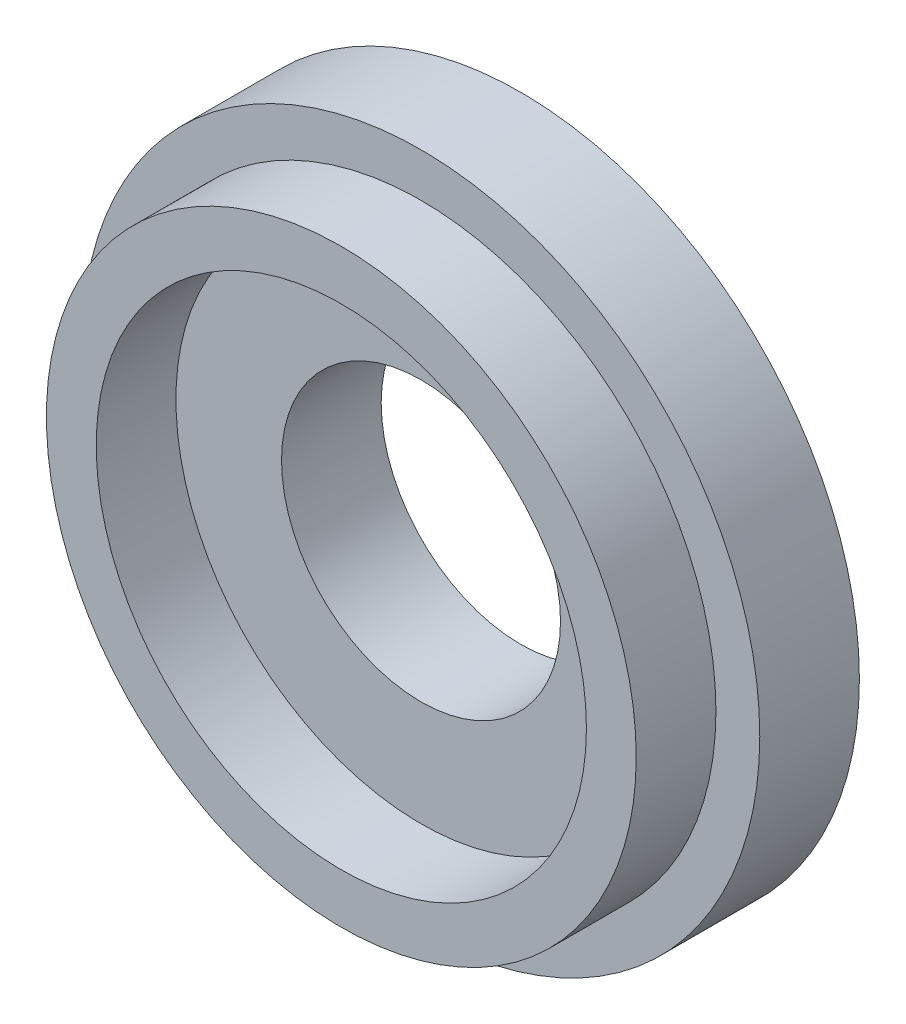
ISO-10303-21;
HEADER;
FILE_DESCRIPTION(('STEP AP214'),'2;1');
FILE_NAME('part.step','',(''),(''),'','','');
FILE_SCHEMA(('AUTOMOTIVE_DESIGN { 1 0 10303 214 1 1 1 1 }'));
ENDSEC;
DATA;
#1=APPLICATION_CONTEXT('core data for automotive mechanical design processes');
#2=APPLICATION_PROTOCOL_DEFINITION('international standard','automotive_design',2000,#1);
#3=PRODUCT_CONTEXT('',#1,'mechanical');
#4=PRODUCT('Part','Part','',(#3));
#5=PRODUCT_RELATED_PRODUCT_CATEGORY('part','',(#4));
#6=PRODUCT_DEFINITION_FORMATION('','',#4);
#7=PRODUCT_DEFINITION_CONTEXT('part definition',#1,'design');
#8=PRODUCT_DEFINITION('design','',#6,#7);
#9=PRODUCT_DEFINITION_SHAPE('','',#8);
#10=(LENGTH_UNIT() NAMED_UNIT(*) SI_UNIT(.MILLI.,.METRE.));
#11=(NAMED_UNIT(*) PLANE_ANGLE_UNIT() SI_UNIT($,.RADIAN.));
#12=(NAMED_UNIT(*) SI_UNIT($,.STERADIAN.) SOLID_ANGLE_UNIT());
#13=UNCERTAINTY_MEASURE_WITH_UNIT(LENGTH_MEASURE(1.E-05),#10,'distance_accuracy_value','');
#14=(GEOMETRIC_REPRESENTATION_CONTEXT(3) GLOBAL_UNCERTAINTY_ASSIGNED_CONTEXT((#13)) GLOBAL_UNIT_ASSIGNED_CONTEXT((#10,
#11,#12)) REPRESENTATION_CONTEXT('',''));
#15=CARTESIAN_POINT('',(0.,0.,0.));
#16=DIRECTION('',(0.,0.,1.));
#17=DIRECTION('',(1.,0.,0.));
#18=AXIS2_PLACEMENT_3D('',#15,#16,#17);
#19=CARTESIAN_POINT('',(0.,3.5,1.90952321796817));
#20=DIRECTION('',(0.,0.,1.));
#21=DIRECTION('',(1.,0.,0.));
#22=AXIS2_PLACEMENT_3D('',#19,#20,#21);
#23=PLANE('',#22);
#24=CARTESIAN_POINT('',(0.,0.,1.90952321796817));
#25=DIRECTION('',(0.,0.,1.));
#26=DIRECTION('',(1.,0.,0.));
#27=AXIS2_PLACEMENT_3D('',#24,#25,#26);
#28=CIRCLE('',#27,8.5);
#29=CARTESIAN_POINT('',(8.5,0.,1.90952321796817));
#30=VERTEX_POINT('',#29);
#31=EDGE_CURVE('E72',#30,#30,#28,.T.);
#32=ORIENTED_EDGE('',*,*,#31,.F.);
#33=EDGE_LOOP('',(#32));
#34=FACE_BOUND('',#33,.T.);
#35=CARTESIAN_POINT('',(0.,0.,1.90952321796817));
#36=DIRECTION('',(0.,0.,1.));
#37=DIRECTION('',(1.,0.,0.));
#38=AXIS2_PLACEMENT_3D('',#35,#36,#37);
#39=CIRCLE('',#38,3.5);
#40=CARTESIAN_POINT('',(3.5,0.,1.90952321796817));
#41=VERTEX_POINT('',#40);
#42=EDGE_CURVE('E10',#41,#41,#39,.T.);
#43=ORIENTED_EDGE('',*,*,#42,.T.);
#44=EDGE_LOOP('',(#43));
#45=FACE_BOUND('',#44,.T.);
#46=ADVANCED_FACE('F37',(#34,#45),#23,.F.);
#47=CARTESIAN_POINT('',(0.,0.,52.974875507707));
#48=DIRECTION('',(0.,0.,1.));
#49=DIRECTION('',(1.,0.,0.));
#50=AXIS2_PLACEMENT_3D('',#47,#48,#49);
#51=CYLINDRICAL_SURFACE('',#50,3.5);
#52=ORIENTED_EDGE('',*,*,#42,.F.);
#53=EDGE_LOOP('',(#52));
#54=FACE_BOUND('',#53,.T.);
#55=CARTESIAN_POINT('',(0.,0.,4.40952321796817));
#56=DIRECTION('',(0.,0.,1.));
#57=DIRECTION('',(1.,0.,0.));
#58=AXIS2_PLACEMENT_3D('',#55,#56,#57);
#59=CIRCLE('',#58,3.5);
#60=CARTESIAN_POINT('',(3.5,0.,4.40952321796817));
#61=VERTEX_POINT('',#60);
#62=EDGE_CURVE('E44',#61,#61,#59,.T.);
#63=ORIENTED_EDGE('',*,*,#62,.T.);
#64=EDGE_LOOP('',(#63));
#65=FACE_BOUND('',#64,.T.);
#66=ADVANCED_FACE('F80',(#54,#65),#51,.F.);
#67=CARTESIAN_POINT('',(0.,4.25,4.40952321796817));
#68=DIRECTION('',(0.,0.,-1.));
#69=DIRECTION('',(-1.,0.,0.));
#70=AXIS2_PLACEMENT_3D('',#67,#68,#69);
#71=PLANE('',#70);
#72=ORIENTED_EDGE('',*,*,#62,.F.);
#73=EDGE_LOOP('',(#72));
#74=FACE_BOUND('',#73,.T.);
#75=CARTESIAN_POINT('',(0.,0.,4.40952321796817));
#76=DIRECTION('',(0.,0.,1.));
#77=DIRECTION('',(1.,0.,0.));
#78=AXIS2_PLACEMENT_3D('',#75,#76,#77);
#79=CIRCLE('',#78,6.15);
#80=CARTESIAN_POINT('',(6.15,0.,4.40952321796817));
#81=VERTEX_POINT('',#80);
#82=EDGE_CURVE('E49',#81,#81,#79,.T.);
#83=ORIENTED_EDGE('',*,*,#82,.T.);
#84=EDGE_LOOP('',(#83));
#85=FACE_BOUND('',#84,.T.);
#86=ADVANCED_FACE('F84',(#74,#85),#71,.F.);
#87=CARTESIAN_POINT('',(0.,0.,52.974875507707));
#88=DIRECTION('',(0.,0.,1.));
#89=DIRECTION('',(1.,0.,0.));
#90=AXIS2_PLACEMENT_3D('',#87,#88,#89);
#91=CYLINDRICAL_SURFACE('',#90,6.15);
#92=ORIENTED_EDGE('',*,*,#82,.F.);
#93=EDGE_LOOP('',(#92));
#94=FACE_BOUND('',#93,.T.);
#95=CARTESIAN_POINT('',(0.,0.,6.40952321796817));
#96=DIRECTION('',(0.,0.,1.));
#97=DIRECTION('',(1.,0.,0.));
#98=AXIS2_PLACEMENT_3D('',#95,#96,#97);
#99=CIRCLE('',#98,6.15);
#100=CARTESIAN_POINT('',(6.15,0.,6.40952321796817));
#101=VERTEX_POINT('',#100);
#102=EDGE_CURVE('E54',#101,#101,#99,.T.);
#103=ORIENTED_EDGE('',*,*,#102,.T.);
#104=EDGE_LOOP('',(#103));
#105=FACE_BOUND('',#104,.T.);
#106=ADVANCED_FACE('F89',(#94,#105),#91,.F.);
#107=CARTESIAN_POINT('',(0.,7.4,6.40952321796817));
#108=DIRECTION('',(0.,0.,-1.));
#109=DIRECTION('',(-1.,0.,0.));
#110=AXIS2_PLACEMENT_3D('',#107,#108,#109);
#111=PLANE('',#110);
#112=ORIENTED_EDGE('',*,*,#102,.F.);
#113=EDGE_LOOP('',(#112));
#114=FACE_BOUND('',#113,.T.);
#115=CARTESIAN_POINT('',(0.,0.,6.40952321796817));
#116=DIRECTION('',(0.,0.,1.));
#117=DIRECTION('',(1.,0.,0.));
#118=AXIS2_PLACEMENT_3D('',#115,#116,#117);
#119=CIRCLE('',#118,7.4);
#120=CARTESIAN_POINT('',(7.4,0.,6.40952321796817));
#121=VERTEX_POINT('',#120);
#122=EDGE_CURVE('E60',#121,#121,#119,.T.);
#123=ORIENTED_EDGE('',*,*,#122,.T.);
#124=EDGE_LOOP('',(#123));
#125=FACE_BOUND('',#124,.T.);
#126=ADVANCED_FACE('F95',(#114,#125),#111,.F.);
#127=CARTESIAN_POINT('',(0.,0.,52.974875507707));
#128=DIRECTION('',(0.,0.,1.));
#129=DIRECTION('',(1.,0.,0.));
#130=AXIS2_PLACEMENT_3D('',#127,#128,#129);
#131=CYLINDRICAL_SURFACE('',#130,7.4);
#132=ORIENTED_EDGE('',*,*,#122,.F.);
#133=EDGE_LOOP('',(#132));
#134=FACE_BOUND('',#133,.T.);
#135=CARTESIAN_POINT('',(0.,0.,4.40952321796817));
#136=DIRECTION('',(0.,0.,1.));
#137=DIRECTION('',(1.,0.,0.));
#138=AXIS2_PLACEMENT_3D('',#135,#136,#137);
#139=CIRCLE('',#138,7.4);
#140=CARTESIAN_POINT('',(7.4,0.,4.40952321796817));
#141=VERTEX_POINT('',#140);
#142=EDGE_CURVE('E64',#141,#141,#139,.T.);
#143=ORIENTED_EDGE('',*,*,#142,.T.);
#144=EDGE_LOOP('',(#143));
#145=FACE_BOUND('',#144,.T.);
#146=ADVANCED_FACE('F99',(#134,#145),#131,.T.);
#147=CARTESIAN_POINT('',(0.,7.4,4.40952321796817));
#148=DIRECTION('',(0.,0.,-1.));
#149=DIRECTION('',(-1.,0.,0.));
#150=AXIS2_PLACEMENT_3D('',#147,#148,#149);
#151=PLANE('',#150);
#152=ORIENTED_EDGE('',*,*,#142,.F.);
#153=EDGE_LOOP('',(#152));
#154=FACE_BOUND('',#153,.T.);
#155=CARTESIAN_POINT('',(0.,0.,4.40952321796817));
#156=DIRECTION('',(0.,0.,1.));
#157=DIRECTION('',(1.,0.,0.));
#158=AXIS2_PLACEMENT_3D('',#155,#156,#157);
#159=CIRCLE('',#158,8.5);
#160=CARTESIAN_POINT('',(8.5,0.,4.40952321796817));
#161=VERTEX_POINT('',#160);
#162=EDGE_CURVE('E68',#161,#161,#159,.T.);
#163=ORIENTED_EDGE('',*,*,#162,.T.);
#164=EDGE_LOOP('',(#163));
#165=FACE_BOUND('',#164,.T.);
#166=ADVANCED_FACE('F103',(#154,#165),#151,.F.);
#167=CARTESIAN_POINT('',(0.,0.,52.974875507707));
#168=DIRECTION('',(0.,0.,1.));
#169=DIRECTION('',(1.,0.,0.));
#170=AXIS2_PLACEMENT_3D('',#167,#168,#169);
#171=CYLINDRICAL_SURFACE('',#170,8.5);
#172=ORIENTED_EDGE('',*,*,#162,.F.);
#173=EDGE_LOOP('',(#172));
#174=FACE_BOUND('',#173,.T.);
#175=ORIENTED_EDGE('',*,*,#31,.T.);
#176=EDGE_LOOP('',(#175));
#177=FACE_BOUND('',#176,.T.);
#178=ADVANCED_FACE('F77',(#174,#177),#171,.T.);
#179=CLOSED_SHELL('',(#46,#66,#86,#106,#126,#146,#166,#178));
#180=MANIFOLD_SOLID_BREP('B2',#179);
#181=ADVANCED_BREP_SHAPE_REPRESENTATION('',(#18,#180),#14);
#182=SHAPE_DEFINITION_REPRESENTATION(#9,#181);
ENDSEC;
END-ISO-10303-21;
